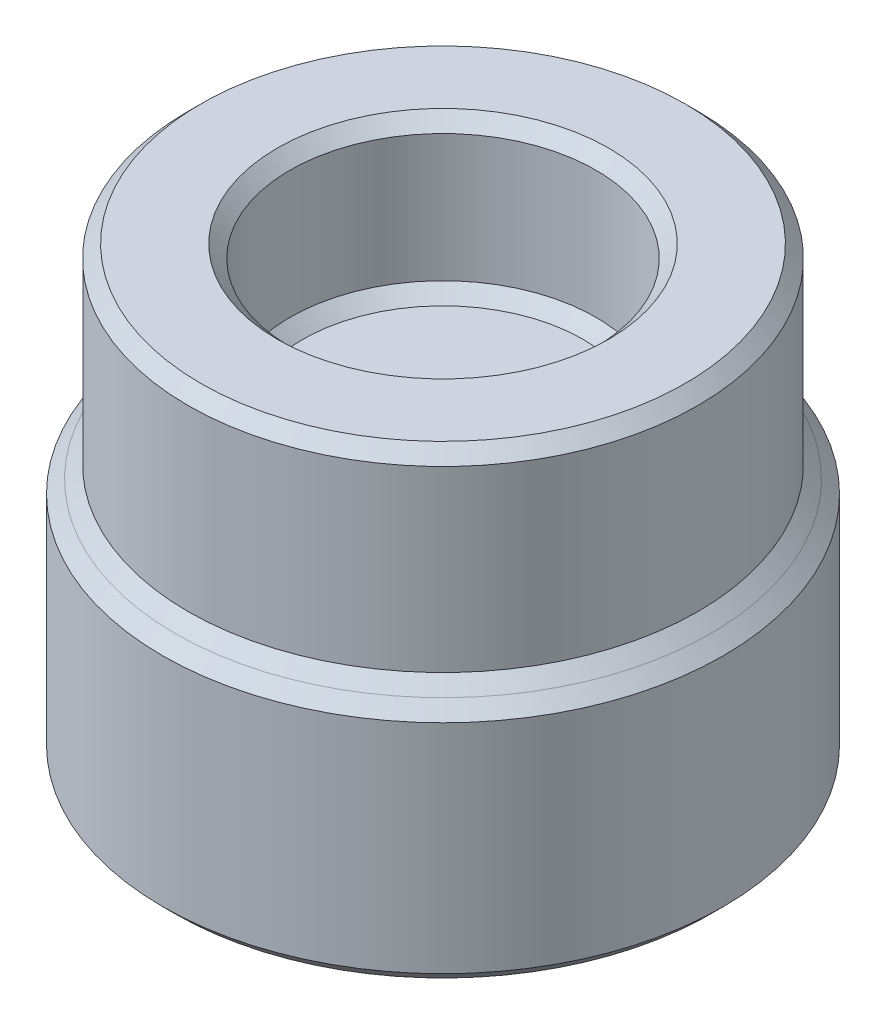
ISO-10303-21;
HEADER;
FILE_DESCRIPTION(('STEP AP214'),'2;1');
FILE_NAME('part.step','',(''),(''),'','','');
FILE_SCHEMA(('AUTOMOTIVE_DESIGN { 1 0 10303 214 1 1 1 1 }'));
ENDSEC;
DATA;
#1=APPLICATION_CONTEXT('core data for automotive mechanical design processes');
#2=APPLICATION_PROTOCOL_DEFINITION('international standard','automotive_design',2000,#1);
#3=PRODUCT_CONTEXT('',#1,'mechanical');
#4=PRODUCT('Part','Part','',(#3));
#5=PRODUCT_RELATED_PRODUCT_CATEGORY('part','',(#4));
#6=PRODUCT_DEFINITION_FORMATION('','',#4);
#7=PRODUCT_DEFINITION_CONTEXT('part definition',#1,'design');
#8=PRODUCT_DEFINITION('design','',#6,#7);
#9=PRODUCT_DEFINITION_SHAPE('','',#8);
#10=(LENGTH_UNIT() NAMED_UNIT(*) SI_UNIT(.MILLI.,.METRE.));
#11=(NAMED_UNIT(*) PLANE_ANGLE_UNIT() SI_UNIT($,.RADIAN.));
#12=(NAMED_UNIT(*) SI_UNIT($,.STERADIAN.) SOLID_ANGLE_UNIT());
#13=UNCERTAINTY_MEASURE_WITH_UNIT(LENGTH_MEASURE(1.E-05),#10,'distance_accuracy_value','');
#14=(GEOMETRIC_REPRESENTATION_CONTEXT(3) GLOBAL_UNCERTAINTY_ASSIGNED_CONTEXT((#13)) GLOBAL_UNIT_ASSIGNED_CONTEXT((#10,
#11,#12)) REPRESENTATION_CONTEXT('',''));
#15=CARTESIAN_POINT('',(0.,0.,0.));
#16=DIRECTION('',(0.,0.,1.));
#17=DIRECTION('',(1.,0.,0.));
#18=AXIS2_PLACEMENT_3D('',#15,#16,#17);
#19=CARTESIAN_POINT('',(0.,1.,0.));
#20=DIRECTION('',(0.,-1.,0.));
#21=DIRECTION('',(0.,0.,-1.));
#22=AXIS2_PLACEMENT_3D('',#19,#20,#21);
#23=CYLINDRICAL_SURFACE('',#22,5.);
#24=CARTESIAN_POINT('',(0.,0.250000000000001,0.));
#25=DIRECTION('',(0.,1.,0.));
#26=DIRECTION('',(0.,0.,1.));
#27=AXIS2_PLACEMENT_3D('',#24,#25,#26);
#28=CIRCLE('',#27,5.);
#29=CARTESIAN_POINT('',(0.,0.250000000000001,5.));
#30=VERTEX_POINT('',#29);
#31=EDGE_CURVE('E12',#30,#30,#28,.T.);
#32=ORIENTED_EDGE('',*,*,#31,.T.);
#33=EDGE_LOOP('',(#32));
#34=FACE_BOUND('',#33,.T.);
#35=CARTESIAN_POINT('',(0.,3.75,0.));
#36=DIRECTION('',(0.,1.,0.));
#37=DIRECTION('',(0.,0.,1.));
#38=AXIS2_PLACEMENT_3D('',#35,#36,#37);
#39=CIRCLE('',#38,5.);
#40=CARTESIAN_POINT('',(0.,3.75,5.));
#41=VERTEX_POINT('',#40);
#42=EDGE_CURVE('E103',#41,#41,#39,.F.);
#43=ORIENTED_EDGE('',*,*,#42,.T.);
#44=EDGE_LOOP('',(#43));
#45=FACE_BOUND('',#44,.T.);
#46=ADVANCED_FACE('F63',(#34,#45),#23,.T.);
#47=CARTESIAN_POINT('',(0.,4.,0.));
#48=DIRECTION('',(0.,1.,0.));
#49=DIRECTION('',(0.,0.,1.));
#50=AXIS2_PLACEMENT_3D('',#47,#48,#49);
#51=PLANE('',#50);
#52=CARTESIAN_POINT('',(0.,4.,0.));
#53=DIRECTION('',(0.,1.,0.));
#54=DIRECTION('',(0.,0.,1.));
#55=AXIS2_PLACEMENT_3D('',#52,#53,#54);
#56=CIRCLE('',#55,3.25);
#57=CARTESIAN_POINT('',(0.,4.,3.25));
#58=VERTEX_POINT('',#57);
#59=EDGE_CURVE('E100',#58,#58,#56,.F.);
#60=ORIENTED_EDGE('',*,*,#59,.T.);
#61=EDGE_LOOP('',(#60));
#62=FACE_BOUND('',#61,.T.);
#63=CARTESIAN_POINT('',(0.,4.,0.));
#64=DIRECTION('',(0.,1.,0.));
#65=DIRECTION('',(0.,0.,1.));
#66=AXIS2_PLACEMENT_3D('',#63,#64,#65);
#67=CIRCLE('',#66,4.75);
#68=CARTESIAN_POINT('',(0.,4.,4.75));
#69=VERTEX_POINT('',#68);
#70=EDGE_CURVE('E97',#69,#69,#67,.T.);
#71=ORIENTED_EDGE('',*,*,#70,.T.);
#72=EDGE_LOOP('',(#71));
#73=FACE_BOUND('',#72,.T.);
#74=ADVANCED_FACE('F136',(#62,#73),#51,.T.);
#75=CARTESIAN_POINT('',(0.,4.,0.));
#76=DIRECTION('',(0.,-1.,0.));
#77=DIRECTION('',(0.,0.,-1.));
#78=AXIS2_PLACEMENT_3D('',#75,#76,#77);
#79=CYLINDRICAL_SURFACE('',#78,3.);
#80=CARTESIAN_POINT('',(0.,3.75,0.));
#81=DIRECTION('',(0.,1.,0.));
#82=DIRECTION('',(0.,0.,1.));
#83=AXIS2_PLACEMENT_3D('',#80,#81,#82);
#84=CIRCLE('',#83,3.);
#85=CARTESIAN_POINT('',(0.,3.75,3.));
#86=VERTEX_POINT('',#85);
#87=EDGE_CURVE('E88',#86,#86,#84,.T.);
#88=ORIENTED_EDGE('',*,*,#87,.T.);
#89=EDGE_LOOP('',(#88));
#90=FACE_BOUND('',#89,.T.);
#91=CARTESIAN_POINT('',(0.,1.25,0.));
#92=DIRECTION('',(0.,1.,0.));
#93=DIRECTION('',(0.,0.,1.));
#94=AXIS2_PLACEMENT_3D('',#91,#92,#93);
#95=CIRCLE('',#94,3.);
#96=CARTESIAN_POINT('',(0.,1.25,3.));
#97=VERTEX_POINT('',#96);
#98=EDGE_CURVE('E84',#97,#97,#95,.F.);
#99=ORIENTED_EDGE('',*,*,#98,.T.);
#100=EDGE_LOOP('',(#99));
#101=FACE_BOUND('',#100,.T.);
#102=ADVANCED_FACE('F142',(#90,#101),#79,.F.);
#103=CARTESIAN_POINT('',(0.,1.,0.));
#104=DIRECTION('',(0.,1.,0.));
#105=DIRECTION('',(0.,0.,1.));
#106=AXIS2_PLACEMENT_3D('',#103,#104,#105);
#107=PLANE('',#106);
#108=CARTESIAN_POINT('',(0.,1.,0.));
#109=DIRECTION('',(0.,1.,0.));
#110=DIRECTION('',(0.,0.,1.));
#111=AXIS2_PLACEMENT_3D('',#108,#109,#110);
#112=CIRCLE('',#111,2.75);
#113=CARTESIAN_POINT('',(0.,1.,2.75));
#114=VERTEX_POINT('',#113);
#115=EDGE_CURVE('E106',#114,#114,#112,.T.);
#116=ORIENTED_EDGE('',*,*,#115,.T.);
#117=EDGE_LOOP('',(#116));
#118=FACE_BOUND('',#117,.T.);
#119=ADVANCED_FACE('F148',(#118),#107,.T.);
#120=CARTESIAN_POINT('',(0.,3.75,0.));
#121=DIRECTION('',(0.,1.,0.));
#122=DIRECTION('',(0.,0.,1.));
#123=AXIS2_PLACEMENT_3D('',#120,#121,#122);
#124=CONICAL_SURFACE('',#123,3.,0.785398163397455);
#125=ORIENTED_EDGE('',*,*,#59,.F.);
#126=EDGE_LOOP('',(#125));
#127=FACE_BOUND('',#126,.T.);
#128=ORIENTED_EDGE('',*,*,#87,.F.);
#129=EDGE_LOOP('',(#128));
#130=FACE_BOUND('',#129,.T.);
#131=ADVANCED_FACE('F150',(#127,#130),#124,.F.);
#132=CARTESIAN_POINT('',(0.,4.,0.));
#133=DIRECTION('',(0.,-1.,0.));
#134=DIRECTION('',(0.,0.,-1.));
#135=AXIS2_PLACEMENT_3D('',#132,#133,#134);
#136=CONICAL_SURFACE('',#135,4.75,0.785398163397441);
#137=ORIENTED_EDGE('',*,*,#42,.F.);
#138=EDGE_LOOP('',(#137));
#139=FACE_BOUND('',#138,.T.);
#140=ORIENTED_EDGE('',*,*,#70,.F.);
#141=EDGE_LOOP('',(#140));
#142=FACE_BOUND('',#141,.T.);
#143=ADVANCED_FACE('F156',(#139,#142),#136,.T.);
#144=CARTESIAN_POINT('',(0.,1.25,0.));
#145=DIRECTION('',(0.,1.,0.));
#146=DIRECTION('',(0.,0.,1.));
#147=AXIS2_PLACEMENT_3D('',#144,#145,#146);
#148=CONICAL_SURFACE('',#147,3.,0.785398163397443);
#149=ORIENTED_EDGE('',*,*,#115,.F.);
#150=EDGE_LOOP('',(#149));
#151=FACE_BOUND('',#150,.T.);
#152=ORIENTED_EDGE('',*,*,#98,.F.);
#153=EDGE_LOOP('',(#152));
#154=FACE_BOUND('',#153,.T.);
#155=ADVANCED_FACE('F163',(#151,#154),#148,.F.);
#156=CARTESIAN_POINT('',(0.,-4.7625,0.));
#157=DIRECTION('',(0.,1.,0.));
#158=DIRECTION('',(0.,0.,1.));
#159=AXIS2_PLACEMENT_3D('',#156,#157,#158);
#160=CYLINDRICAL_SURFACE('',#159,5.5);
#161=CARTESIAN_POINT('',(0.,-4.51249999999999,0.));
#162=DIRECTION('',(0.,1.,0.));
#163=DIRECTION('',(0.,0.,1.));
#164=AXIS2_PLACEMENT_3D('',#161,#162,#163);
#165=CIRCLE('',#164,5.5);
#166=CARTESIAN_POINT('',(0.,-4.51249999999999,5.5));
#167=VERTEX_POINT('',#166);
#168=EDGE_CURVE('E112',#167,#167,#165,.T.);
#169=CARTESIAN_POINT('',(0.,-0.249999999999994,0.));
#170=DIRECTION('',(0.,1.,0.));
#171=DIRECTION('',(0.,0.,1.));
#172=AXIS2_PLACEMENT_3D('',#169,#170,#171);
#173=CIRCLE('',#172,5.5);
#174=CARTESIAN_POINT('',(0.,-0.249999999999995,5.5));
#175=VERTEX_POINT('',#174);
#176=EDGE_CURVE('E109',#175,#175,#173,.F.);
#177=CARTESIAN_POINT('',(0.,-4.51249999999999,5.5));
#178=CARTESIAN_POINT('',(0.,-4.46809895833332,5.5));
#179=CARTESIAN_POINT('',(0.,-4.42369791666666,5.5));
#180=CARTESIAN_POINT('',(0.,-4.33489583333332,5.5));
#181=CARTESIAN_POINT('',(0.,-4.29049479166666,5.5));
#182=CARTESIAN_POINT('',(0.,-4.20169270833332,5.5));
#183=CARTESIAN_POINT('',(0.,-4.15729166666666,5.5));
#184=CARTESIAN_POINT('',(0.,-4.06848958333332,5.5));
#185=CARTESIAN_POINT('',(0.,-4.02408854166666,5.5));
#186=CARTESIAN_POINT('',(0.,-3.93528645833332,5.5));
#187=CARTESIAN_POINT('',(0.,-3.89088541666666,5.5));
#188=CARTESIAN_POINT('',(0.,-3.80208333333333,5.5));
#189=CARTESIAN_POINT('',(0.,-3.75768229166666,5.5));
#190=CARTESIAN_POINT('',(0.,-3.66888020833333,5.5));
#191=CARTESIAN_POINT('',(0.,-3.62447916666666,5.5));
#192=CARTESIAN_POINT('',(0.,-3.53567708333333,5.5));
#193=CARTESIAN_POINT('',(0.,-3.49127604166666,5.5));
#194=CARTESIAN_POINT('',(0.,-3.40247395833333,5.5));
#195=CARTESIAN_POINT('',(0.,-3.35807291666666,5.5));
#196=CARTESIAN_POINT('',(0.,-3.26927083333333,5.5));
#197=CARTESIAN_POINT('',(0.,-3.22486979166666,5.5));
#198=CARTESIAN_POINT('',(0.,-3.13606770833333,5.5));
#199=CARTESIAN_POINT('',(0.,-3.09166666666666,5.5));
#200=CARTESIAN_POINT('',(0.,-3.00286458333333,5.5));
#201=CARTESIAN_POINT('',(0.,-2.95846354166666,5.5));
#202=CARTESIAN_POINT('',(0.,-2.86966145833333,5.5));
#203=CARTESIAN_POINT('',(0.,-2.82526041666666,5.5));
#204=CARTESIAN_POINT('',(0.,-2.73645833333333,5.5));
#205=CARTESIAN_POINT('',(0.,-2.69205729166666,5.5));
#206=CARTESIAN_POINT('',(0.,-2.60325520833333,5.5));
#207=CARTESIAN_POINT('',(0.,-2.55885416666666,5.5));
#208=CARTESIAN_POINT('',(0.,-2.47005208333333,5.5));
#209=CARTESIAN_POINT('',(0.,-2.42565104166666,5.5));
#210=CARTESIAN_POINT('',(0.,-2.33684895833333,5.5));
#211=CARTESIAN_POINT('',(0.,-2.29244791666666,5.5));
#212=CARTESIAN_POINT('',(0.,-2.20364583333333,5.5));
#213=CARTESIAN_POINT('',(0.,-2.15924479166666,5.5));
#214=CARTESIAN_POINT('',(0.,-2.07044270833333,5.5));
#215=CARTESIAN_POINT('',(0.,-2.02604166666666,5.5));
#216=CARTESIAN_POINT('',(0.,-1.93723958333333,5.5));
#217=CARTESIAN_POINT('',(0.,-1.89283854166666,5.5));
#218=CARTESIAN_POINT('',(0.,-1.80403645833333,5.5));
#219=CARTESIAN_POINT('',(0.,-1.75963541666666,5.5));
#220=CARTESIAN_POINT('',(0.,-1.67083333333333,5.5));
#221=CARTESIAN_POINT('',(0.,-1.62643229166666,5.5));
#222=CARTESIAN_POINT('',(0.,-1.53763020833333,5.5));
#223=CARTESIAN_POINT('',(0.,-1.49322916666666,5.5));
#224=CARTESIAN_POINT('',(0.,-1.40442708333333,5.5));
#225=CARTESIAN_POINT('',(0.,-1.36002604166666,5.5));
#226=CARTESIAN_POINT('',(0.,-1.27122395833333,5.5));
#227=CARTESIAN_POINT('',(0.,-1.22682291666666,5.5));
#228=CARTESIAN_POINT('',(0.,-1.13802083333333,5.5));
#229=CARTESIAN_POINT('',(0.,-1.09361979166666,5.5));
#230=CARTESIAN_POINT('',(0.,-1.00481770833333,5.5));
#231=CARTESIAN_POINT('',(0.,-0.96041666666666,5.5));
#232=CARTESIAN_POINT('',(0.,-0.871614583333327,5.5));
#233=CARTESIAN_POINT('',(0.,-0.82721354166666,5.5));
#234=CARTESIAN_POINT('',(0.,-0.738411458333327,5.5));
#235=CARTESIAN_POINT('',(0.,-0.694010416666661,5.5));
#236=CARTESIAN_POINT('',(0.,-0.605208333333328,5.5));
#237=CARTESIAN_POINT('',(0.,-0.560807291666662,5.5));
#238=CARTESIAN_POINT('',(0.,-0.472005208333328,5.5));
#239=CARTESIAN_POINT('',(0.,-0.427604166666662,5.5));
#240=CARTESIAN_POINT('',(0.,-0.338802083333328,5.5));
#241=CARTESIAN_POINT('',(0.,-0.294401041666662,5.5));
#242=CARTESIAN_POINT('',(0.,-0.249999999999995,5.5));
#243=B_SPLINE_CURVE_WITH_KNOTS('',3,(#177,#178,#179,#180,#181,#182,#183,#184,#185,#186,#187,
#188,#189,#190,#191,#192,#193,#194,#195,#196,#197,#198,#199,#200,#201,#202,#203,#204,#205,#206,
#207,#208,#209,#210,#211,#212,#213,#214,#215,#216,#217,#218,#219,#220,#221,#222,#223,#224,#225,
#226,#227,#228,#229,#230,#231,#232,#233,#234,#235,#236,#237,#238,#239,#240,#241,#242),
.UNSPECIFIED.,.F.,.F.,(4,2,2,2,2,2,2,2,2,2,2,2,2,2,2,2,2,2,2,2,2,2,2,2,2,2,2,2,2,2,2,2,4),(0.,
0.133203125,0.26640625,0.399609375,0.5328125,0.666015625,0.79921875,0.932421875,1.065625,
1.198828125,1.33203125,1.465234375,1.5984375,1.731640625,1.86484375,1.998046875,2.13125,
2.264453125,2.39765625,2.530859375,2.6640625,2.797265625,2.93046875,3.063671875,3.196875,
3.330078125,3.46328125,3.596484375,3.7296875,3.862890625,3.99609375,4.129296875,4.2625),.UNSPECIFIED.);
#244=EDGE_CURVE('BSEAM169',#167,#175,#243,.T.);
#245=ORIENTED_EDGE('',*,*,#168,.T.);
#246=ORIENTED_EDGE('',*,*,#176,.T.);
#247=ORIENTED_EDGE('',*,*,#244,.T.);
#248=ORIENTED_EDGE('',*,*,#244,.F.);
#249=EDGE_LOOP('',(#245,#247,#246,#248));
#250=FACE_BOUND('',#249,.T.);
#251=ADVANCED_FACE('F169',(#250),#160,.T.);
#252=CARTESIAN_POINT('',(0.,-4.7625,0.));
#253=DIRECTION('',(0.,1.,0.));
#254=DIRECTION('',(0.,0.,1.));
#255=AXIS2_PLACEMENT_3D('',#252,#253,#254);
#256=PLANE('',#255);
#257=CARTESIAN_POINT('',(0.,-4.7625,0.));
#258=DIRECTION('',(0.,1.,0.));
#259=DIRECTION('',(0.,0.,1.));
#260=AXIS2_PLACEMENT_3D('',#257,#258,#259);
#261=CIRCLE('',#260,5.24999999999999);
#262=CARTESIAN_POINT('',(0.,-4.7625,5.24999999999999));
#263=VERTEX_POINT('',#262);
#264=EDGE_CURVE('E115',#263,#263,#261,.F.);
#265=ORIENTED_EDGE('',*,*,#264,.T.);
#266=EDGE_LOOP('',(#265));
#267=FACE_BOUND('',#266,.T.);
#268=CARTESIAN_POINT('',(0.,-4.7625,0.));
#269=DIRECTION('',(0.,-1.,0.));
#270=DIRECTION('',(0.,0.,-1.));
#271=AXIS2_PLACEMENT_3D('',#268,#269,#270);
#272=CIRCLE('',#271,3.4417);
#273=CARTESIAN_POINT('',(0.,-4.7625,-3.4417));
#274=VERTEX_POINT('',#273);
#275=EDGE_CURVE('E91',#274,#274,#272,.T.);
#276=ORIENTED_EDGE('',*,*,#275,.F.);
#277=EDGE_LOOP('',(#276));
#278=FACE_BOUND('',#277,.T.);
#279=ADVANCED_FACE('F78',(#267,#278),#256,.F.);
#280=CARTESIAN_POINT('',(0.,-0.497396936754448,0.));
#281=DIRECTION('',(0.,-1.,0.));
#282=DIRECTION('',(0.,0.,-1.));
#283=AXIS2_PLACEMENT_3D('',#280,#281,#282);
#284=CONICAL_SURFACE('',#283,2.8067,1.39626340159546);
#285=CARTESIAN_POINT('',(0.,-0.00250000000000077,0.));
#286=VERTEX_POINT('',#285);
#287=VERTEX_LOOP('',#286);
#288=FACE_BOUND('',#287,.T.);
#289=CARTESIAN_POINT('',(0.,-0.497396936754448,0.));
#290=DIRECTION('',(0.,-1.,0.));
#291=DIRECTION('',(0.,0.,-1.));
#292=AXIS2_PLACEMENT_3D('',#289,#290,#291);
#293=CIRCLE('',#292,2.8067);
#294=CARTESIAN_POINT('',(0.,-0.497396936754448,-2.8067));
#295=VERTEX_POINT('',#294);
#296=EDGE_CURVE('E82',#295,#295,#293,.T.);
#297=ORIENTED_EDGE('',*,*,#296,.T.);
#298=EDGE_LOOP('',(#297));
#299=FACE_BOUND('',#298,.T.);
#300=ADVANCED_FACE('F74',(#288,#299),#284,.F.);
#301=CARTESIAN_POINT('',(0.,-4.7625,0.));
#302=DIRECTION('',(0.,-1.,0.));
#303=DIRECTION('',(0.,0.,-1.));
#304=AXIS2_PLACEMENT_3D('',#301,#302,#303);
#305=CYLINDRICAL_SURFACE('',#304,2.8067);
#306=ORIENTED_EDGE('',*,*,#296,.F.);
#307=EDGE_LOOP('',(#306));
#308=FACE_BOUND('',#307,.T.);
#309=CARTESIAN_POINT('',(0.,-4.1275,0.));
#310=DIRECTION('',(0.,-1.,0.));
#311=DIRECTION('',(0.,0.,-1.));
#312=AXIS2_PLACEMENT_3D('',#309,#310,#311);
#313=CIRCLE('',#312,2.8067);
#314=CARTESIAN_POINT('',(0.,-4.1275,-2.8067));
#315=VERTEX_POINT('',#314);
#316=EDGE_CURVE('E85',#315,#315,#313,.T.);
#317=ORIENTED_EDGE('',*,*,#316,.T.);
#318=EDGE_LOOP('',(#317));
#319=FACE_BOUND('',#318,.T.);
#320=ADVANCED_FACE('F77',(#308,#319),#305,.F.);
#321=CARTESIAN_POINT('',(0.,-4.7625,0.));
#322=DIRECTION('',(0.,-1.,0.));
#323=DIRECTION('',(0.,0.,-1.));
#324=AXIS2_PLACEMENT_3D('',#321,#322,#323);
#325=CONICAL_SURFACE('',#324,3.4417,0.785398163397447);
#326=ORIENTED_EDGE('',*,*,#316,.F.);
#327=EDGE_LOOP('',(#326));
#328=FACE_BOUND('',#327,.T.);
#329=ORIENTED_EDGE('',*,*,#275,.T.);
#330=EDGE_LOOP('',(#329));
#331=FACE_BOUND('',#330,.T.);
#332=ADVANCED_FACE('F131',(#328,#331),#325,.F.);
#333=CARTESIAN_POINT('',(0.,-4.51249999999999,0.));
#334=DIRECTION('',(0.,1.,0.));
#335=DIRECTION('',(0.,0.,1.));
#336=AXIS2_PLACEMENT_3D('',#333,#334,#335);
#337=CONICAL_SURFACE('',#336,5.5,0.78539816339745);
#338=CARTESIAN_POINT('',(0.,-4.7625,5.24999999999999));
#339=CARTESIAN_POINT('',(0.,-4.75989583333333,5.25260416666666));
#340=CARTESIAN_POINT('',(0.,-4.75729166666667,5.25520833333332));
#341=CARTESIAN_POINT('',(0.,-4.75208333333333,5.26041666666666));
#342=CARTESIAN_POINT('',(0.,-4.74947916666667,5.26302083333332));
#343=CARTESIAN_POINT('',(0.,-4.74427083333333,5.26822916666666));
#344=CARTESIAN_POINT('',(0.,-4.74166666666667,5.27083333333332));
#345=CARTESIAN_POINT('',(0.,-4.73645833333333,5.27604166666666));
#346=CARTESIAN_POINT('',(0.,-4.73385416666667,5.27864583333332));
#347=CARTESIAN_POINT('',(0.,-4.72864583333333,5.28385416666666));
#348=CARTESIAN_POINT('',(0.,-4.72604166666667,5.28645833333332));
#349=CARTESIAN_POINT('',(0.,-4.72083333333333,5.29166666666666));
#350=CARTESIAN_POINT('',(0.,-4.71822916666667,5.29427083333332));
#351=CARTESIAN_POINT('',(0.,-4.71302083333333,5.29947916666666));
#352=CARTESIAN_POINT('',(0.,-4.71041666666666,5.30208333333332));
#353=CARTESIAN_POINT('',(0.,-4.70520833333333,5.30729166666666));
#354=CARTESIAN_POINT('',(0.,-4.70260416666666,5.30989583333332));
#355=CARTESIAN_POINT('',(0.,-4.69739583333333,5.31510416666666));
#356=CARTESIAN_POINT('',(0.,-4.69479166666666,5.31770833333332));
#357=CARTESIAN_POINT('',(0.,-4.68958333333333,5.32291666666666));
#358=CARTESIAN_POINT('',(0.,-4.68697916666666,5.32552083333333));
#359=CARTESIAN_POINT('',(0.,-4.68177083333333,5.33072916666666));
#360=CARTESIAN_POINT('',(0.,-4.67916666666666,5.33333333333333));
#361=CARTESIAN_POINT('',(0.,-4.67395833333333,5.33854166666666));
#362=CARTESIAN_POINT('',(0.,-4.67135416666666,5.34114583333333));
#363=CARTESIAN_POINT('',(0.,-4.66614583333333,5.34635416666666));
#364=CARTESIAN_POINT('',(0.,-4.66354166666666,5.34895833333333));
#365=CARTESIAN_POINT('',(0.,-4.65833333333333,5.35416666666666));
#366=CARTESIAN_POINT('',(0.,-4.65572916666666,5.35677083333333));
#367=CARTESIAN_POINT('',(0.,-4.65052083333333,5.36197916666666));
#368=CARTESIAN_POINT('',(0.,-4.64791666666666,5.36458333333333));
#369=CARTESIAN_POINT('',(0.,-4.64270833333333,5.36979166666666));
#370=CARTESIAN_POINT('',(0.,-4.64010416666666,5.37239583333333));
#371=CARTESIAN_POINT('',(0.,-4.63489583333333,5.37760416666666));
#372=CARTESIAN_POINT('',(0.,-4.63229166666666,5.38020833333333));
#373=CARTESIAN_POINT('',(0.,-4.62708333333333,5.38541666666666));
#374=CARTESIAN_POINT('',(0.,-4.62447916666666,5.38802083333333));
#375=CARTESIAN_POINT('',(0.,-4.61927083333333,5.39322916666666));
#376=CARTESIAN_POINT('',(0.,-4.61666666666666,5.39583333333333));
#377=CARTESIAN_POINT('',(0.,-4.61145833333333,5.40104166666666));
#378=CARTESIAN_POINT('',(0.,-4.60885416666666,5.40364583333333));
#379=CARTESIAN_POINT('',(0.,-4.60364583333333,5.40885416666666));
#380=CARTESIAN_POINT('',(0.,-4.60104166666666,5.41145833333333));
#381=CARTESIAN_POINT('',(0.,-4.59583333333333,5.41666666666666));
#382=CARTESIAN_POINT('',(0.,-4.59322916666666,5.41927083333333));
#383=CARTESIAN_POINT('',(0.,-4.58802083333333,5.42447916666666));
#384=CARTESIAN_POINT('',(0.,-4.58541666666666,5.42708333333333));
#385=CARTESIAN_POINT('',(0.,-4.58020833333333,5.43229166666666));
#386=CARTESIAN_POINT('',(0.,-4.57760416666666,5.43489583333333));
#387=CARTESIAN_POINT('',(0.,-4.57239583333333,5.44010416666666));
#388=CARTESIAN_POINT('',(0.,-4.56979166666666,5.44270833333333));
#389=CARTESIAN_POINT('',(0.,-4.56458333333333,5.44791666666666));
#390=CARTESIAN_POINT('',(0.,-4.56197916666666,5.45052083333333));
#391=CARTESIAN_POINT('',(0.,-4.55677083333333,5.45572916666666));
#392=CARTESIAN_POINT('',(0.,-4.55416666666666,5.45833333333333));
#393=CARTESIAN_POINT('',(0.,-4.54895833333333,5.46354166666666));
#394=CARTESIAN_POINT('',(0.,-4.54635416666666,5.46614583333333));
#395=CARTESIAN_POINT('',(0.,-4.54114583333333,5.47135416666666));
#396=CARTESIAN_POINT('',(0.,-4.53854166666666,5.47395833333333));
#397=CARTESIAN_POINT('',(0.,-4.53333333333333,5.47916666666667));
#398=CARTESIAN_POINT('',(0.,-4.53072916666666,5.48177083333333));
#399=CARTESIAN_POINT('',(0.,-4.52552083333333,5.48697916666667));
#400=CARTESIAN_POINT('',(0.,-4.52291666666666,5.48958333333333));
#401=CARTESIAN_POINT('',(0.,-4.51770833333332,5.49479166666667));
#402=CARTESIAN_POINT('',(0.,-4.51510416666666,5.49739583333333));
#403=CARTESIAN_POINT('',(0.,-4.51249999999999,5.5));
#404=B_SPLINE_CURVE_WITH_KNOTS('',3,(#338,#339,#340,#341,#342,#343,#344,#345,#346,#347,#348,
#349,#350,#351,#352,#353,#354,#355,#356,#357,#358,#359,#360,#361,#362,#363,#364,#365,#366,#367,
#368,#369,#370,#371,#372,#373,#374,#375,#376,#377,#378,#379,#380,#381,#382,#383,#384,#385,#386,
#387,#388,#389,#390,#391,#392,#393,#394,#395,#396,#397,#398,#399,#400,#401,#402,#403),
.UNSPECIFIED.,.F.,.F.,(4,2,2,2,2,2,2,2,2,2,2,2,2,2,2,2,2,2,2,2,2,2,2,2,2,2,2,2,2,2,2,2,4),(0.,
0.0110485434560398,0.0220970869120796,0.0331456303681207,0.0441941738241605,0.0552427172802003,
0.0662912607362414,0.0773398041922812,0.088388347648321,0.099436891104362,0.110485434560402,
0.121533978016442,0.132582521472483,0.143631064928523,0.154679608384563,0.165728151840603,
0.176776695296644,0.187825238752684,0.198873782208724,0.209922325664764,0.220970869120804,
0.232019412576845,0.243067956032885,0.254116499488925,0.265165042944965,0.276213586401006,
0.287262129857046,0.298310673313087,0.309359216769126,0.320407760225166,0.331456303681207,
0.342504847137247,0.353553390593288),.UNSPECIFIED.);
#405=EDGE_CURVE('BSEAM124',#263,#167,#404,.T.);
#406=ORIENTED_EDGE('',*,*,#264,.F.);
#407=ORIENTED_EDGE('',*,*,#168,.F.);
#408=ORIENTED_EDGE('',*,*,#405,.T.);
#409=ORIENTED_EDGE('',*,*,#405,.F.);
#410=EDGE_LOOP('',(#406,#408,#407,#409));
#411=FACE_BOUND('',#410,.T.);
#412=ADVANCED_FACE('F124',(#411),#337,.T.);
#413=CARTESIAN_POINT('',(0.,0.,0.));
#414=DIRECTION('',(0.,-1.,0.));
#415=DIRECTION('',(0.,0.,-1.));
#416=AXIS2_PLACEMENT_3D('',#413,#414,#415);
#417=CONICAL_SURFACE('',#416,5.25000000000001,0.785398163397445);
#418=ORIENTED_EDGE('',*,*,#176,.F.);
#419=EDGE_LOOP('',(#418));
#420=FACE_BOUND('',#419,.T.);
#421=CARTESIAN_POINT('',(0.,0.,0.));
#422=DIRECTION('',(0.,1.,0.));
#423=DIRECTION('',(0.,0.,1.));
#424=AXIS2_PLACEMENT_3D('',#421,#422,#423);
#425=CIRCLE('',#424,5.25000000000001);
#426=CARTESIAN_POINT('',(0.,0.,5.25000000000001));
#427=VERTEX_POINT('',#426);
#428=EDGE_CURVE('E71',#427,#427,#425,.T.);
#429=ORIENTED_EDGE('',*,*,#428,.F.);
#430=EDGE_LOOP('',(#429));
#431=FACE_BOUND('',#430,.T.);
#432=ADVANCED_FACE('F122',(#420,#431),#417,.T.);
#433=CARTESIAN_POINT('',(0.,0.250000000000001,0.));
#434=DIRECTION('',(0.,-1.,0.));
#435=DIRECTION('',(0.,0.,-1.));
#436=AXIS2_PLACEMENT_3D('',#433,#434,#435);
#437=CONICAL_SURFACE('',#436,5.,0.785398163397445);
#438=ORIENTED_EDGE('',*,*,#428,.T.);
#439=EDGE_LOOP('',(#438));
#440=FACE_BOUND('',#439,.T.);
#441=ORIENTED_EDGE('',*,*,#31,.F.);
#442=EDGE_LOOP('',(#441));
#443=FACE_BOUND('',#442,.T.);
#444=ADVANCED_FACE('F66',(#440,#443),#437,.T.);
#445=CLOSED_SHELL('',(#46,#74,#102,#119,#131,#143,#155,#251,#279,#300,#320,#332,#412,#432,#444));
#446=MANIFOLD_SOLID_BREP('B2',#445);
#447=ADVANCED_BREP_SHAPE_REPRESENTATION('',(#18,#446),#14);
#448=SHAPE_DEFINITION_REPRESENTATION(#9,#447);
ENDSEC;
END-ISO-10303-21;
